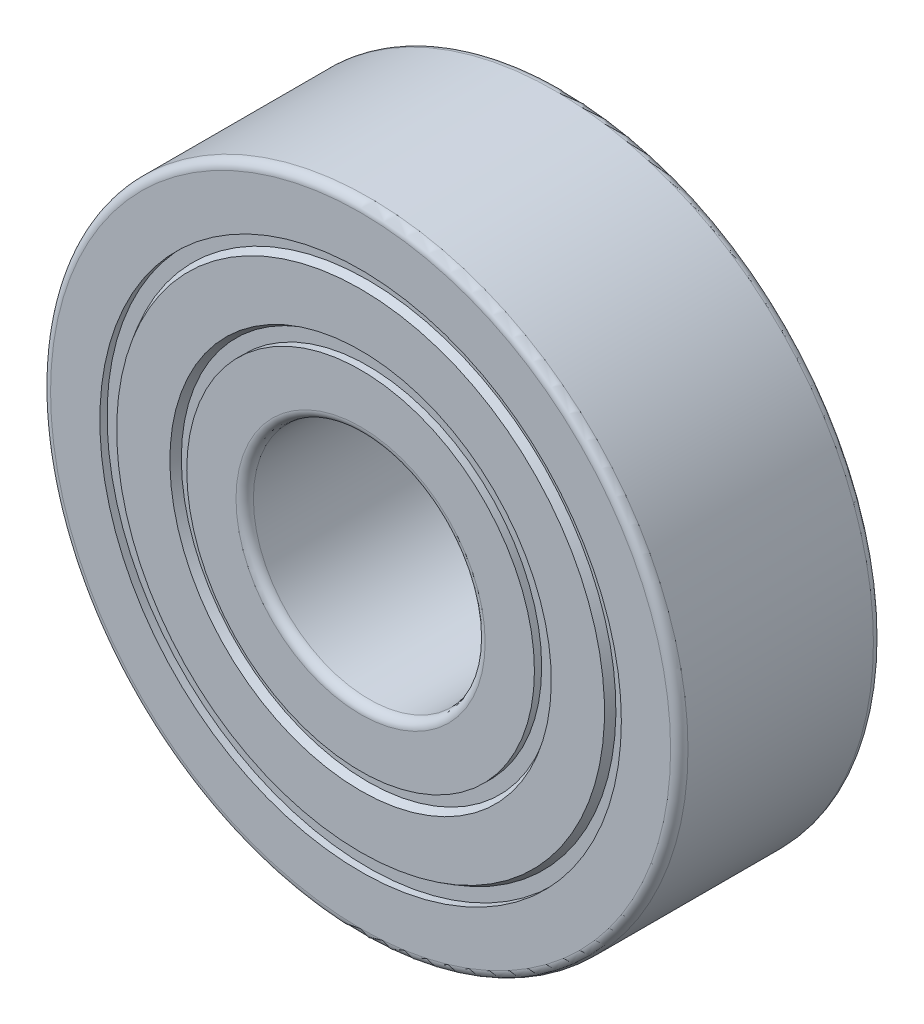
ISO-10303-21;
HEADER;
FILE_DESCRIPTION(('STEP AP214'),'2;1');
FILE_NAME('part.step','',(''),(''),'','','');
FILE_SCHEMA(('AUTOMOTIVE_DESIGN { 1 0 10303 214 1 1 1 1 }'));
ENDSEC;
DATA;
#1=APPLICATION_CONTEXT('core data for automotive mechanical design processes');
#2=APPLICATION_PROTOCOL_DEFINITION('international standard','automotive_design',2000,#1);
#3=PRODUCT_CONTEXT('',#1,'mechanical');
#4=PRODUCT('Part','Part','',(#3));
#5=PRODUCT_RELATED_PRODUCT_CATEGORY('part','',(#4));
#6=PRODUCT_DEFINITION_FORMATION('','',#4);
#7=PRODUCT_DEFINITION_CONTEXT('part definition',#1,'design');
#8=PRODUCT_DEFINITION('design','',#6,#7);
#9=PRODUCT_DEFINITION_SHAPE('','',#8);
#10=(LENGTH_UNIT() NAMED_UNIT(*) SI_UNIT(.MILLI.,.METRE.));
#11=(NAMED_UNIT(*) PLANE_ANGLE_UNIT() SI_UNIT($,.RADIAN.));
#12=(NAMED_UNIT(*) SI_UNIT($,.STERADIAN.) SOLID_ANGLE_UNIT());
#13=UNCERTAINTY_MEASURE_WITH_UNIT(LENGTH_MEASURE(1.E-05),#10,'distance_accuracy_value','');
#14=(GEOMETRIC_REPRESENTATION_CONTEXT(3) GLOBAL_UNCERTAINTY_ASSIGNED_CONTEXT((#13)) GLOBAL_UNIT_ASSIGNED_CONTEXT((#10,
#11,#12)) REPRESENTATION_CONTEXT('',''));
#15=CARTESIAN_POINT('',(0.,0.,0.));
#16=DIRECTION('',(0.,0.,1.));
#17=DIRECTION('',(1.,0.,0.));
#18=AXIS2_PLACEMENT_3D('',#15,#16,#17);
#19=CARTESIAN_POINT('',(0.,0.,2.72220369349935));
#20=DIRECTION('',(0.,0.,1.));
#21=DIRECTION('',(1.,0.,0.));
#22=AXIS2_PLACEMENT_3D('',#19,#20,#21);
#23=CYLINDRICAL_SURFACE('',#22,4.);
#24=CARTESIAN_POINT('',(0.,0.,3.2));
#25=DIRECTION('',(0.,0.,-1.));
#26=DIRECTION('',(-1.,0.,0.));
#27=AXIS2_PLACEMENT_3D('',#24,#25,#26);
#28=CIRCLE('',#27,4.);
#29=CARTESIAN_POINT('',(-4.,0.,3.2));
#30=VERTEX_POINT('',#29);
#31=EDGE_CURVE('E107',#30,#30,#28,.T.);
#32=ORIENTED_EDGE('',*,*,#31,.F.);
#33=EDGE_LOOP('',(#32));
#34=FACE_BOUND('',#33,.T.);
#35=CARTESIAN_POINT('',(0.,0.,-3.2));
#36=DIRECTION('',(0.,0.,-1.));
#37=DIRECTION('',(-1.,0.,0.));
#38=AXIS2_PLACEMENT_3D('',#35,#36,#37);
#39=CIRCLE('',#38,4.);
#40=CARTESIAN_POINT('',(-4.,0.,-3.2));
#41=VERTEX_POINT('',#40);
#42=EDGE_CURVE('E70',#41,#41,#39,.F.);
#43=ORIENTED_EDGE('',*,*,#42,.F.);
#44=EDGE_LOOP('',(#43));
#45=FACE_BOUND('',#44,.T.);
#46=ADVANCED_FACE('F18',(#34,#45),#23,.F.);
#47=CARTESIAN_POINT('',(0.,0.,3.2));
#48=DIRECTION('',(0.,0.,-1.));
#49=DIRECTION('',(-1.,0.,0.));
#50=AXIS2_PLACEMENT_3D('',#47,#48,#49);
#51=TOROIDAL_SURFACE('',#50,4.3,0.299999999999999);
#52=ORIENTED_EDGE('',*,*,#31,.T.);
#53=EDGE_LOOP('',(#52));
#54=FACE_BOUND('',#53,.T.);
#55=CARTESIAN_POINT('',(0.,0.,3.5));
#56=DIRECTION('',(0.,0.,1.));
#57=DIRECTION('',(-1.,0.,0.));
#58=AXIS2_PLACEMENT_3D('',#55,#56,#57);
#59=CIRCLE('',#58,4.3);
#60=CARTESIAN_POINT('',(-4.29999999999999,0.,3.5));
#61=VERTEX_POINT('',#60);
#62=CARTESIAN_POINT('',(4.3,0.,3.5));
#63=VERTEX_POINT('',#62);
#64=EDGE_CURVE('E56',#61,#63,#59,.T.);
#65=ORIENTED_EDGE('',*,*,#64,.T.);
#66=CARTESIAN_POINT('',(0.,0.,3.5));
#67=DIRECTION('',(0.,0.,1.));
#68=DIRECTION('',(1.,0.,0.));
#69=AXIS2_PLACEMENT_3D('',#66,#67,#68);
#70=CIRCLE('',#69,4.3);
#71=EDGE_CURVE('E59',#63,#61,#70,.T.);
#72=ORIENTED_EDGE('',*,*,#71,.T.);
#73=EDGE_LOOP('',(#65,#72));
#74=FACE_BOUND('',#73,.T.);
#75=ADVANCED_FACE('F61',(#54,#74),#51,.T.);
#76=CARTESIAN_POINT('',(0.,0.,-3.2));
#77=DIRECTION('',(0.,0.,-1.));
#78=DIRECTION('',(-1.,0.,0.));
#79=AXIS2_PLACEMENT_3D('',#76,#77,#78);
#80=TOROIDAL_SURFACE('',#79,4.3,0.299999999999999);
#81=CARTESIAN_POINT('',(0.,0.,-3.5));
#82=DIRECTION('',(0.,0.,-1.));
#83=DIRECTION('',(-1.,0.,0.));
#84=AXIS2_PLACEMENT_3D('',#81,#82,#83);
#85=CIRCLE('',#84,4.3);
#86=CARTESIAN_POINT('',(4.3,0.,-3.5));
#87=VERTEX_POINT('',#86);
#88=CARTESIAN_POINT('',(-4.3,0.,-3.5));
#89=VERTEX_POINT('',#88);
#90=EDGE_CURVE('E113',#87,#89,#85,.F.);
#91=ORIENTED_EDGE('',*,*,#90,.F.);
#92=CARTESIAN_POINT('',(0.,0.,-3.5));
#93=DIRECTION('',(0.,0.,-1.));
#94=DIRECTION('',(1.,0.,0.));
#95=AXIS2_PLACEMENT_3D('',#92,#93,#94);
#96=CIRCLE('',#95,4.3);
#97=EDGE_CURVE('E64',#89,#87,#96,.F.);
#98=ORIENTED_EDGE('',*,*,#97,.F.);
#99=EDGE_LOOP('',(#91,#98));
#100=FACE_BOUND('',#99,.T.);
#101=ORIENTED_EDGE('',*,*,#42,.T.);
#102=EDGE_LOOP('',(#101));
#103=FACE_BOUND('',#102,.T.);
#104=ADVANCED_FACE('F90',(#100,#103),#80,.T.);
#105=CARTESIAN_POINT('',(3.67168283958829,0.,3.49999999999999));
#106=DIRECTION('',(0.,0.,-1.));
#107=DIRECTION('',(-1.,0.,0.));
#108=AXIS2_PLACEMENT_3D('',#105,#106,#107);
#109=PLANE('',#108);
#110=ORIENTED_EDGE('',*,*,#64,.F.);
#111=ORIENTED_EDGE('',*,*,#71,.F.);
#112=EDGE_LOOP('',(#110,#111));
#113=FACE_BOUND('',#112,.T.);
#114=CARTESIAN_POINT('',(0.,0.,3.49999999999999));
#115=DIRECTION('',(0.,0.,1.));
#116=DIRECTION('',(1.,0.,0.));
#117=AXIS2_PLACEMENT_3D('',#114,#115,#116);
#118=CIRCLE('',#117,6.);
#119=CARTESIAN_POINT('',(6.,0.,3.49999999999999));
#120=VERTEX_POINT('',#119);
#121=EDGE_CURVE('E21',#120,#120,#118,.F.);
#122=ORIENTED_EDGE('',*,*,#121,.F.);
#123=EDGE_LOOP('',(#122));
#124=FACE_BOUND('',#123,.T.);
#125=ADVANCED_FACE('F68',(#113,#124),#109,.F.);
#126=CARTESIAN_POINT('',(4.83575292704006,0.,-3.49999999999999));
#127=DIRECTION('',(0.,0.,-1.));
#128=DIRECTION('',(-1.,0.,0.));
#129=AXIS2_PLACEMENT_3D('',#126,#127,#128);
#130=PLANE('',#129);
#131=ORIENTED_EDGE('',*,*,#97,.T.);
#132=ORIENTED_EDGE('',*,*,#90,.T.);
#133=EDGE_LOOP('',(#131,#132));
#134=FACE_BOUND('',#133,.T.);
#135=CARTESIAN_POINT('',(0.,0.,-3.49999999999999));
#136=DIRECTION('',(0.,0.,1.));
#137=DIRECTION('',(1.,0.,0.));
#138=AXIS2_PLACEMENT_3D('',#135,#136,#137);
#139=CIRCLE('',#138,6.);
#140=CARTESIAN_POINT('',(6.,0.,-3.49999999999999));
#141=VERTEX_POINT('',#140);
#142=EDGE_CURVE('E196',#141,#141,#139,.T.);
#143=ORIENTED_EDGE('',*,*,#142,.F.);
#144=EDGE_LOOP('',(#143));
#145=FACE_BOUND('',#144,.T.);
#146=ADVANCED_FACE('F89',(#134,#145),#130,.T.);
#147=CARTESIAN_POINT('',(0.,0.,2.72220369349935));
#148=DIRECTION('',(0.,0.,1.));
#149=DIRECTION('',(1.,0.,0.));
#150=AXIS2_PLACEMENT_3D('',#147,#148,#149);
#151=CYLINDRICAL_SURFACE('',#150,6.);
#152=CARTESIAN_POINT('',(0.,0.,3.25));
#153=DIRECTION('',(0.,0.,1.));
#154=DIRECTION('',(1.,0.,0.));
#155=AXIS2_PLACEMENT_3D('',#152,#153,#154);
#156=CIRCLE('',#155,6.);
#157=CARTESIAN_POINT('',(6.,0.,3.25));
#158=VERTEX_POINT('',#157);
#159=EDGE_CURVE('E194',#158,#158,#156,.T.);
#160=ORIENTED_EDGE('',*,*,#159,.T.);
#161=EDGE_LOOP('',(#160));
#162=FACE_BOUND('',#161,.T.);
#163=ORIENTED_EDGE('',*,*,#121,.T.);
#164=EDGE_LOOP('',(#163));
#165=FACE_BOUND('',#164,.T.);
#166=ADVANCED_FACE('F459',(#162,#165),#151,.T.);
#167=CARTESIAN_POINT('',(0.,0.,2.72220369349935));
#168=DIRECTION('',(0.,0.,1.));
#169=DIRECTION('',(1.,0.,0.));
#170=AXIS2_PLACEMENT_3D('',#167,#168,#169);
#171=CYLINDRICAL_SURFACE('',#170,6.);
#172=ORIENTED_EDGE('',*,*,#142,.T.);
#173=EDGE_LOOP('',(#172));
#174=FACE_BOUND('',#173,.T.);
#175=CARTESIAN_POINT('',(0.,0.,-3.25));
#176=DIRECTION('',(0.,0.,1.));
#177=DIRECTION('',(1.,0.,0.));
#178=AXIS2_PLACEMENT_3D('',#175,#176,#177);
#179=CIRCLE('',#178,6.);
#180=CARTESIAN_POINT('',(6.,0.,-3.25));
#181=VERTEX_POINT('',#180);
#182=EDGE_CURVE('E191',#181,#181,#179,.T.);
#183=ORIENTED_EDGE('',*,*,#182,.F.);
#184=EDGE_LOOP('',(#183));
#185=FACE_BOUND('',#184,.T.);
#186=ADVANCED_FACE('F451',(#174,#185),#171,.T.);
#187=CARTESIAN_POINT('',(4.7886238638191,0.,3.25));
#188=DIRECTION('',(0.,0.,-1.));
#189=DIRECTION('',(-1.,0.,0.));
#190=AXIS2_PLACEMENT_3D('',#187,#188,#189);
#191=PLANE('',#190);
#192=ORIENTED_EDGE('',*,*,#159,.F.);
#193=EDGE_LOOP('',(#192));
#194=FACE_BOUND('',#193,.T.);
#195=CARTESIAN_POINT('',(0.,0.,3.25000000003683));
#196=DIRECTION('',(0.,0.,1.));
#197=DIRECTION('',(0.,-1.,0.));
#198=AXIS2_PLACEMENT_3D('',#195,#196,#197);
#199=CIRCLE('',#198,6.43750000000409);
#200=CARTESIAN_POINT('',(0.,-6.43750000000409,3.25000000003683));
#201=VERTEX_POINT('',#200);
#202=EDGE_CURVE('E188',#201,#201,#199,.T.);
#203=ORIENTED_EDGE('',*,*,#202,.T.);
#204=EDGE_LOOP('',(#203));
#205=FACE_BOUND('',#204,.T.);
#206=ADVANCED_FACE('F443',(#194,#205),#191,.F.);
#207=CARTESIAN_POINT('',(5.95269395127089,0.,-3.25));
#208=DIRECTION('',(0.,0.,-1.));
#209=DIRECTION('',(-1.,0.,0.));
#210=AXIS2_PLACEMENT_3D('',#207,#208,#209);
#211=PLANE('',#210);
#212=ORIENTED_EDGE('',*,*,#182,.T.);
#213=EDGE_LOOP('',(#212));
#214=FACE_BOUND('',#213,.T.);
#215=CARTESIAN_POINT('',(0.,0.,-3.25000000003683));
#216=DIRECTION('',(0.,0.,-1.));
#217=DIRECTION('',(0.,1.,0.));
#218=AXIS2_PLACEMENT_3D('',#215,#216,#217);
#219=CIRCLE('',#218,6.43750000000409);
#220=CARTESIAN_POINT('',(0.,6.43750000000409,-3.25000000003683));
#221=VERTEX_POINT('',#220);
#222=EDGE_CURVE('E185',#221,#221,#219,.T.);
#223=ORIENTED_EDGE('',*,*,#222,.T.);
#224=EDGE_LOOP('',(#223));
#225=FACE_BOUND('',#224,.T.);
#226=ADVANCED_FACE('F435',(#214,#225),#211,.T.);
#227=CARTESIAN_POINT('',(0.,0.,3.50000001412809));
#228=DIRECTION('',(0.,0.,1.));
#229=DIRECTION('',(0.,-1.,0.));
#230=AXIS2_PLACEMENT_3D('',#227,#228,#229);
#231=CONICAL_SURFACE('',#230,6.58183757542474,0.523598775561258);
#232=CARTESIAN_POINT('',(0.,0.,3.50000001412809));
#233=DIRECTION('',(0.,0.,1.));
#234=DIRECTION('',(0.,-1.,0.));
#235=AXIS2_PLACEMENT_3D('',#232,#233,#234);
#236=CIRCLE('',#235,6.58183757542474);
#237=CARTESIAN_POINT('',(0.,-6.58183757542474,3.50000001412809));
#238=VERTEX_POINT('',#237);
#239=EDGE_CURVE('E182',#238,#238,#236,.T.);
#240=ORIENTED_EDGE('',*,*,#239,.T.);
#241=EDGE_LOOP('',(#240));
#242=FACE_BOUND('',#241,.T.);
#243=ORIENTED_EDGE('',*,*,#202,.F.);
#244=EDGE_LOOP('',(#243));
#245=FACE_BOUND('',#244,.T.);
#246=ADVANCED_FACE('F427',(#242,#245),#231,.F.);
#247=CARTESIAN_POINT('',(0.,0.,-3.50000001412809));
#248=DIRECTION('',(0.,0.,-1.));
#249=DIRECTION('',(0.,1.,0.));
#250=AXIS2_PLACEMENT_3D('',#247,#248,#249);
#251=CONICAL_SURFACE('',#250,6.58183757542474,0.523598775561258);
#252=CARTESIAN_POINT('',(0.,0.,-3.50000001412809));
#253=DIRECTION('',(0.,0.,-1.));
#254=DIRECTION('',(0.,1.,0.));
#255=AXIS2_PLACEMENT_3D('',#252,#253,#254);
#256=CIRCLE('',#255,6.58183757542474);
#257=CARTESIAN_POINT('',(0.,6.58183757542474,-3.50000001412809));
#258=VERTEX_POINT('',#257);
#259=EDGE_CURVE('E179',#258,#258,#256,.F.);
#260=ORIENTED_EDGE('',*,*,#259,.F.);
#261=EDGE_LOOP('',(#260));
#262=FACE_BOUND('',#261,.T.);
#263=ORIENTED_EDGE('',*,*,#222,.F.);
#264=EDGE_LOOP('',(#263));
#265=FACE_BOUND('',#264,.T.);
#266=ADVANCED_FACE('F419',(#262,#265),#251,.F.);
#267=CARTESIAN_POINT('',(6.38202192516636,0.,3.49999999999999));
#268=DIRECTION('',(0.,0.,-1.));
#269=DIRECTION('',(-1.,0.,0.));
#270=AXIS2_PLACEMENT_3D('',#267,#268,#269);
#271=PLANE('',#270);
#272=ORIENTED_EDGE('',*,*,#239,.F.);
#273=EDGE_LOOP('',(#272));
#274=FACE_BOUND('',#273,.T.);
#275=CARTESIAN_POINT('',(0.,0.,3.49999999999999));
#276=DIRECTION('',(0.,0.,-1.));
#277=DIRECTION('',(0.,1.,0.));
#278=AXIS2_PLACEMENT_3D('',#275,#276,#277);
#279=CIRCLE('',#278,8.4181624);
#280=CARTESIAN_POINT('',(0.,8.4181624,3.49999999999999));
#281=VERTEX_POINT('',#280);
#282=EDGE_CURVE('E176',#281,#281,#279,.T.);
#283=ORIENTED_EDGE('',*,*,#282,.F.);
#284=EDGE_LOOP('',(#283));
#285=FACE_BOUND('',#284,.T.);
#286=ADVANCED_FACE('F411',(#274,#285),#271,.F.);
#287=CARTESIAN_POINT('',(7.54609201261815,0.,-3.49999999999999));
#288=DIRECTION('',(0.,0.,-1.));
#289=DIRECTION('',(-1.,0.,0.));
#290=AXIS2_PLACEMENT_3D('',#287,#288,#289);
#291=PLANE('',#290);
#292=ORIENTED_EDGE('',*,*,#259,.T.);
#293=EDGE_LOOP('',(#292));
#294=FACE_BOUND('',#293,.T.);
#295=CARTESIAN_POINT('',(0.,0.,-3.49999999999999));
#296=DIRECTION('',(0.,0.,1.));
#297=DIRECTION('',(1.,0.,0.));
#298=AXIS2_PLACEMENT_3D('',#295,#296,#297);
#299=CIRCLE('',#298,8.4181624);
#300=CARTESIAN_POINT('',(8.4181624,0.,-3.49999999999999));
#301=VERTEX_POINT('',#300);
#302=EDGE_CURVE('E173',#301,#301,#299,.T.);
#303=ORIENTED_EDGE('',*,*,#302,.F.);
#304=EDGE_LOOP('',(#303));
#305=FACE_BOUND('',#304,.T.);
#306=ADVANCED_FACE('F403',(#294,#305),#291,.T.);
#307=CARTESIAN_POINT('',(0.,0.,3.24999998583961));
#308=DIRECTION('',(0.,0.,-1.));
#309=DIRECTION('',(0.,1.,0.));
#310=AXIS2_PLACEMENT_3D('',#307,#308,#309);
#311=CONICAL_SURFACE('',#310,8.56249997547347,0.523598775600001);
#312=ORIENTED_EDGE('',*,*,#282,.T.);
#313=EDGE_LOOP('',(#312));
#314=FACE_BOUND('',#313,.T.);
#315=CARTESIAN_POINT('',(0.,0.,3.24999998583961));
#316=DIRECTION('',(0.,0.,-1.));
#317=DIRECTION('',(0.,1.,0.));
#318=AXIS2_PLACEMENT_3D('',#315,#316,#317);
#319=CIRCLE('',#318,8.56249997547347);
#320=CARTESIAN_POINT('',(0.,8.56249997547347,3.24999998583961));
#321=VERTEX_POINT('',#320);
#322=EDGE_CURVE('E170',#321,#321,#319,.F.);
#323=ORIENTED_EDGE('',*,*,#322,.T.);
#324=EDGE_LOOP('',(#323));
#325=FACE_BOUND('',#324,.T.);
#326=ADVANCED_FACE('F395',(#314,#325),#311,.T.);
#327=CARTESIAN_POINT('',(0.,0.,-3.24999998583961));
#328=DIRECTION('',(0.,0.,1.));
#329=DIRECTION('',(1.,0.,0.));
#330=AXIS2_PLACEMENT_3D('',#327,#328,#329);
#331=CONICAL_SURFACE('',#330,8.56249997547347,0.523598775600002);
#332=ORIENTED_EDGE('',*,*,#302,.T.);
#333=EDGE_LOOP('',(#332));
#334=FACE_BOUND('',#333,.T.);
#335=CARTESIAN_POINT('',(0.,0.,-3.24999998583961));
#336=DIRECTION('',(0.,0.,1.));
#337=DIRECTION('',(1.,0.,0.));
#338=AXIS2_PLACEMENT_3D('',#335,#336,#337);
#339=CIRCLE('',#338,8.56249997547347);
#340=CARTESIAN_POINT('',(8.56249997547347,0.,-3.24999998583961));
#341=VERTEX_POINT('',#340);
#342=EDGE_CURVE('E167',#341,#341,#339,.T.);
#343=ORIENTED_EDGE('',*,*,#342,.F.);
#344=EDGE_LOOP('',(#343));
#345=FACE_BOUND('',#344,.T.);
#346=ADVANCED_FACE('F387',(#334,#345),#331,.T.);
#347=CARTESIAN_POINT('',(7.87388015942853,0.,3.25));
#348=DIRECTION('',(0.,0.,-1.));
#349=DIRECTION('',(-1.,0.,0.));
#350=AXIS2_PLACEMENT_3D('',#347,#348,#349);
#351=PLANE('',#350);
#352=ORIENTED_EDGE('',*,*,#322,.F.);
#353=EDGE_LOOP('',(#352));
#354=FACE_BOUND('',#353,.T.);
#355=CARTESIAN_POINT('',(0.,0.,3.25));
#356=DIRECTION('',(0.,0.,1.));
#357=DIRECTION('',(1.,0.,0.));
#358=AXIS2_PLACEMENT_3D('',#355,#356,#357);
#359=CIRCLE('',#358,8.99999999999999);
#360=CARTESIAN_POINT('',(8.99999999999999,0.,3.25));
#361=VERTEX_POINT('',#360);
#362=EDGE_CURVE('E164',#361,#361,#359,.T.);
#363=ORIENTED_EDGE('',*,*,#362,.T.);
#364=EDGE_LOOP('',(#363));
#365=FACE_BOUND('',#364,.T.);
#366=ADVANCED_FACE('F379',(#354,#365),#351,.F.);
#367=CARTESIAN_POINT('',(9.03795024688032,0.,-3.25));
#368=DIRECTION('',(0.,0.,-1.));
#369=DIRECTION('',(-1.,0.,0.));
#370=AXIS2_PLACEMENT_3D('',#367,#368,#369);
#371=PLANE('',#370);
#372=ORIENTED_EDGE('',*,*,#342,.T.);
#373=EDGE_LOOP('',(#372));
#374=FACE_BOUND('',#373,.T.);
#375=CARTESIAN_POINT('',(0.,0.,-3.25));
#376=DIRECTION('',(0.,0.,1.));
#377=DIRECTION('',(1.,0.,0.));
#378=AXIS2_PLACEMENT_3D('',#375,#376,#377);
#379=CIRCLE('',#378,8.99999999999999);
#380=CARTESIAN_POINT('',(8.99999999999999,0.,-3.25));
#381=VERTEX_POINT('',#380);
#382=EDGE_CURVE('E161',#381,#381,#379,.F.);
#383=ORIENTED_EDGE('',*,*,#382,.T.);
#384=EDGE_LOOP('',(#383));
#385=FACE_BOUND('',#384,.T.);
#386=ADVANCED_FACE('F372',(#374,#385),#371,.T.);
#387=CARTESIAN_POINT('',(0.,0.,2.72220369349935));
#388=DIRECTION('',(0.,0.,1.));
#389=DIRECTION('',(1.,0.,0.));
#390=AXIS2_PLACEMENT_3D('',#387,#388,#389);
#391=CYLINDRICAL_SURFACE('',#390,8.99999999999999);
#392=CARTESIAN_POINT('',(0.,0.,3.49999999999999));
#393=DIRECTION('',(0.,0.,1.));
#394=DIRECTION('',(1.,0.,0.));
#395=AXIS2_PLACEMENT_3D('',#392,#393,#394);
#396=CIRCLE('',#395,8.99999999999999);
#397=CARTESIAN_POINT('',(8.99999999999999,0.,3.49999999999999));
#398=VERTEX_POINT('',#397);
#399=EDGE_CURVE('E158',#398,#398,#396,.T.);
#400=ORIENTED_EDGE('',*,*,#399,.T.);
#401=EDGE_LOOP('',(#400));
#402=FACE_BOUND('',#401,.T.);
#403=ORIENTED_EDGE('',*,*,#362,.F.);
#404=EDGE_LOOP('',(#403));
#405=FACE_BOUND('',#404,.T.);
#406=ADVANCED_FACE('F365',(#402,#405),#391,.F.);
#407=CARTESIAN_POINT('',(0.,0.,2.72220369349935));
#408=DIRECTION('',(0.,0.,1.));
#409=DIRECTION('',(1.,0.,0.));
#410=AXIS2_PLACEMENT_3D('',#407,#408,#409);
#411=CYLINDRICAL_SURFACE('',#410,8.99999999999999);
#412=ORIENTED_EDGE('',*,*,#382,.F.);
#413=EDGE_LOOP('',(#412));
#414=FACE_BOUND('',#413,.T.);
#415=CARTESIAN_POINT('',(0.,0.,-3.49999999999999));
#416=DIRECTION('',(0.,0.,1.));
#417=DIRECTION('',(1.,0.,0.));
#418=AXIS2_PLACEMENT_3D('',#415,#416,#417);
#419=CIRCLE('',#418,8.99999999999999);
#420=CARTESIAN_POINT('',(8.99999999999999,0.,-3.49999999999999));
#421=VERTEX_POINT('',#420);
#422=EDGE_CURVE('E149',#421,#421,#419,.T.);
#423=ORIENTED_EDGE('',*,*,#422,.F.);
#424=EDGE_LOOP('',(#423));
#425=FACE_BOUND('',#424,.T.);
#426=ADVANCED_FACE('F299',(#414,#425),#411,.F.);
#427=CARTESIAN_POINT('',(8.81117323869755,0.,3.49999999999999));
#428=DIRECTION('',(0.,0.,-1.));
#429=DIRECTION('',(-1.,0.,0.));
#430=AXIS2_PLACEMENT_3D('',#427,#428,#429);
#431=PLANE('',#430);
#432=ORIENTED_EDGE('',*,*,#399,.F.);
#433=EDGE_LOOP('',(#432));
#434=FACE_BOUND('',#433,.T.);
#435=CARTESIAN_POINT('',(0.,0.,3.5));
#436=DIRECTION('',(0.,0.,-1.));
#437=DIRECTION('',(-1.,0.,0.));
#438=AXIS2_PLACEMENT_3D('',#435,#436,#437);
#439=CIRCLE('',#438,10.7);
#440=CARTESIAN_POINT('',(-10.7,0.,3.5));
#441=VERTEX_POINT('',#440);
#442=CARTESIAN_POINT('',(10.7,0.,3.5));
#443=VERTEX_POINT('',#442);
#444=EDGE_CURVE('E285',#441,#443,#439,.T.);
#445=ORIENTED_EDGE('',*,*,#444,.F.);
#446=CARTESIAN_POINT('',(0.,0.,3.5));
#447=DIRECTION('',(0.,0.,-1.));
#448=DIRECTION('',(1.,0.,0.));
#449=AXIS2_PLACEMENT_3D('',#446,#447,#448);
#450=CIRCLE('',#449,10.7);
#451=EDGE_CURVE('E157',#443,#441,#450,.T.);
#452=ORIENTED_EDGE('',*,*,#451,.F.);
#453=EDGE_LOOP('',(#445,#452));
#454=FACE_BOUND('',#453,.T.);
#455=ADVANCED_FACE('F290',(#434,#454),#431,.F.);
#456=CARTESIAN_POINT('',(9.97524332614934,0.,-3.49999999999999));
#457=DIRECTION('',(0.,0.,-1.));
#458=DIRECTION('',(-1.,0.,0.));
#459=AXIS2_PLACEMENT_3D('',#456,#457,#458);
#460=PLANE('',#459);
#461=ORIENTED_EDGE('',*,*,#422,.T.);
#462=EDGE_LOOP('',(#461));
#463=FACE_BOUND('',#462,.T.);
#464=CARTESIAN_POINT('',(0.,0.,-3.5));
#465=DIRECTION('',(0.,0.,1.));
#466=DIRECTION('',(1.,0.,0.));
#467=AXIS2_PLACEMENT_3D('',#464,#465,#466);
#468=CIRCLE('',#467,10.7);
#469=CARTESIAN_POINT('',(10.7,0.,-3.5));
#470=VERTEX_POINT('',#469);
#471=CARTESIAN_POINT('',(-10.7,0.,-3.5));
#472=VERTEX_POINT('',#471);
#473=EDGE_CURVE('E246',#470,#472,#468,.T.);
#474=ORIENTED_EDGE('',*,*,#473,.F.);
#475=CARTESIAN_POINT('',(0.,0.,-3.5));
#476=DIRECTION('',(0.,0.,1.));
#477=DIRECTION('',(-1.,0.,0.));
#478=AXIS2_PLACEMENT_3D('',#475,#476,#477);
#479=CIRCLE('',#478,10.7);
#480=EDGE_CURVE('E35',#472,#470,#479,.T.);
#481=ORIENTED_EDGE('',*,*,#480,.F.);
#482=EDGE_LOOP('',(#474,#481));
#483=FACE_BOUND('',#482,.T.);
#484=ADVANCED_FACE('F233',(#463,#483),#460,.T.);
#485=CARTESIAN_POINT('',(0.,0.,3.2));
#486=DIRECTION('',(0.,0.,-1.));
#487=DIRECTION('',(-1.,0.,0.));
#488=AXIS2_PLACEMENT_3D('',#485,#486,#487);
#489=TOROIDAL_SURFACE('',#488,10.7,0.299999999999999);
#490=ORIENTED_EDGE('',*,*,#444,.T.);
#491=ORIENTED_EDGE('',*,*,#451,.T.);
#492=EDGE_LOOP('',(#490,#491));
#493=FACE_BOUND('',#492,.T.);
#494=CARTESIAN_POINT('',(0.,0.,3.2));
#495=DIRECTION('',(0.,0.,1.));
#496=DIRECTION('',(1.,0.,0.));
#497=AXIS2_PLACEMENT_3D('',#494,#495,#496);
#498=CIRCLE('',#497,11.);
#499=CARTESIAN_POINT('',(11.,0.,3.2));
#500=VERTEX_POINT('',#499);
#501=EDGE_CURVE('E27',#500,#500,#498,.F.);
#502=ORIENTED_EDGE('',*,*,#501,.F.);
#503=EDGE_LOOP('',(#502));
#504=FACE_BOUND('',#503,.T.);
#505=ADVANCED_FACE('F221',(#493,#504),#489,.T.);
#506=CARTESIAN_POINT('',(0.,0.,-3.2));
#507=DIRECTION('',(0.,0.,-1.));
#508=DIRECTION('',(-1.,0.,0.));
#509=AXIS2_PLACEMENT_3D('',#506,#507,#508);
#510=TOROIDAL_SURFACE('',#509,10.7,0.299999999999999);
#511=CARTESIAN_POINT('',(0.,0.,-3.2));
#512=DIRECTION('',(0.,0.,1.));
#513=DIRECTION('',(1.,0.,0.));
#514=AXIS2_PLACEMENT_3D('',#511,#512,#513);
#515=CIRCLE('',#514,11.);
#516=CARTESIAN_POINT('',(11.,0.,-3.2));
#517=VERTEX_POINT('',#516);
#518=EDGE_CURVE('E11',#517,#517,#515,.T.);
#519=ORIENTED_EDGE('',*,*,#518,.F.);
#520=EDGE_LOOP('',(#519));
#521=FACE_BOUND('',#520,.T.);
#522=ORIENTED_EDGE('',*,*,#480,.T.);
#523=ORIENTED_EDGE('',*,*,#473,.T.);
#524=EDGE_LOOP('',(#522,#523));
#525=FACE_BOUND('',#524,.T.);
#526=ADVANCED_FACE('F232',(#521,#525),#510,.T.);
#527=CARTESIAN_POINT('',(0.,0.,2.72220369349935));
#528=DIRECTION('',(0.,0.,1.));
#529=DIRECTION('',(1.,0.,0.));
#530=AXIS2_PLACEMENT_3D('',#527,#528,#529);
#531=CYLINDRICAL_SURFACE('',#530,11.);
#532=ORIENTED_EDGE('',*,*,#518,.T.);
#533=EDGE_LOOP('',(#532));
#534=FACE_BOUND('',#533,.T.);
#535=ORIENTED_EDGE('',*,*,#501,.T.);
#536=EDGE_LOOP('',(#535));
#537=FACE_BOUND('',#536,.T.);
#538=ADVANCED_FACE('F332',(#534,#537),#531,.T.);
#539=CLOSED_SHELL('',(#46,#75,#104,#125,#146,#166,#186,#206,#226,#246,#266,#286,#306,#326,#346,
#366,#386,#406,#426,#455,#484,#505,#526,#538));
#540=CARTESIAN_POINT('',(0.,0.,0.));
#541=DIRECTION('',(0.,0.,-1.));
#542=DIRECTION('',(-1.,0.,0.));
#543=AXIS2_PLACEMENT_3D('',#540,#541,#542);
#544=TOROIDAL_SURFACE('',#543,7.5,2.1875);
#545=ADVANCED_FACE('F329',(),#544,.F.);
#546=CLOSED_SHELL('',(#545));
#547=ORIENTED_CLOSED_SHELL('',*,#546,.T.);
#548=BREP_WITH_VOIDS('B1',#539,(#547));
#549=ADVANCED_BREP_SHAPE_REPRESENTATION('',(#18,#548),#14);
#550=SHAPE_DEFINITION_REPRESENTATION(#9,#549);
ENDSEC;
END-ISO-10303-21;
